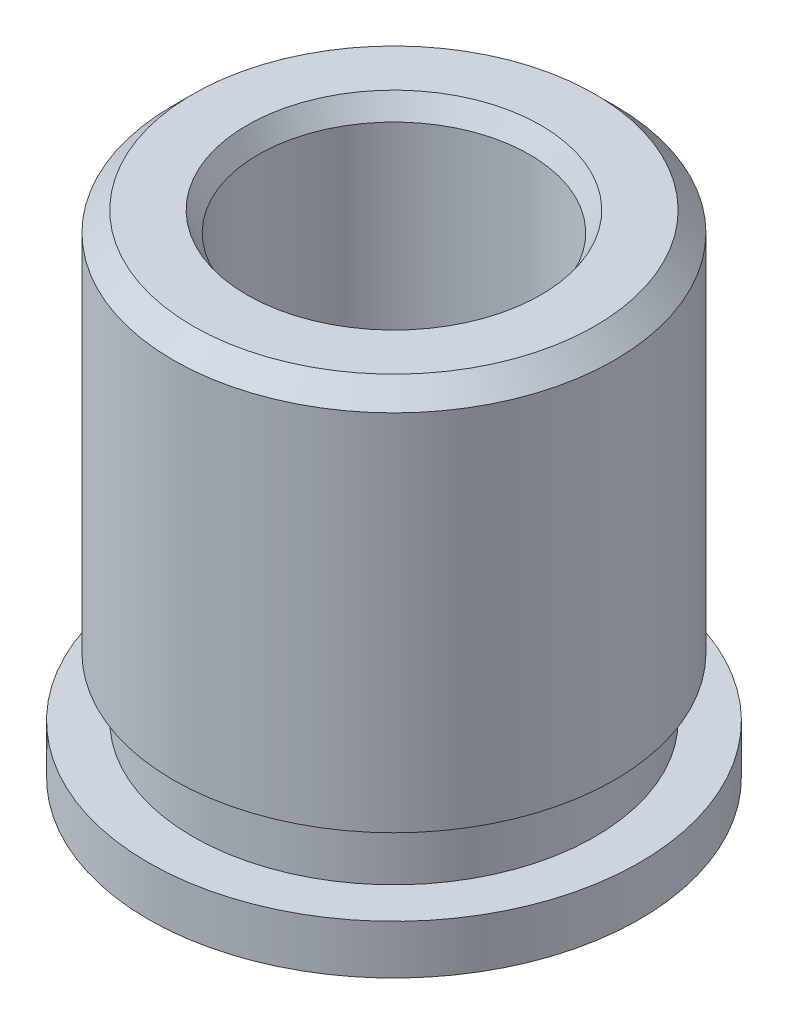
ISO-10303-21;
HEADER;
FILE_DESCRIPTION(('STEP AP214'),'2;1');
FILE_NAME('part.step','',(''),(''),'','','');
FILE_SCHEMA(('AUTOMOTIVE_DESIGN { 1 0 10303 214 1 1 1 1 }'));
ENDSEC;
DATA;
#1=APPLICATION_CONTEXT('core data for automotive mechanical design processes');
#2=APPLICATION_PROTOCOL_DEFINITION('international standard','automotive_design',2000,#1);
#3=PRODUCT_CONTEXT('',#1,'mechanical');
#4=PRODUCT('Part','Part','',(#3));
#5=PRODUCT_RELATED_PRODUCT_CATEGORY('part','',(#4));
#6=PRODUCT_DEFINITION_FORMATION('','',#4);
#7=PRODUCT_DEFINITION_CONTEXT('part definition',#1,'design');
#8=PRODUCT_DEFINITION('design','',#6,#7);
#9=PRODUCT_DEFINITION_SHAPE('','',#8);
#10=(LENGTH_UNIT() NAMED_UNIT(*) SI_UNIT(.MILLI.,.METRE.));
#11=(NAMED_UNIT(*) PLANE_ANGLE_UNIT() SI_UNIT($,.RADIAN.));
#12=(NAMED_UNIT(*) SI_UNIT($,.STERADIAN.) SOLID_ANGLE_UNIT());
#13=UNCERTAINTY_MEASURE_WITH_UNIT(LENGTH_MEASURE(1.E-05),#10,'distance_accuracy_value','');
#14=(GEOMETRIC_REPRESENTATION_CONTEXT(3) GLOBAL_UNCERTAINTY_ASSIGNED_CONTEXT((#13)) GLOBAL_UNIT_ASSIGNED_CONTEXT((#10,
#11,#12)) REPRESENTATION_CONTEXT('',''));
#15=CARTESIAN_POINT('',(0.,0.,0.));
#16=DIRECTION('',(0.,0.,1.));
#17=DIRECTION('',(1.,0.,0.));
#18=AXIS2_PLACEMENT_3D('',#15,#16,#17);
#19=CARTESIAN_POINT('',(0.,3.175,0.));
#20=DIRECTION('',(0.,1.,0.));
#21=DIRECTION('',(0.,0.,1.));
#22=AXIS2_PLACEMENT_3D('',#19,#20,#21);
#23=CYLINDRICAL_SURFACE('',#22,3.175);
#24=CARTESIAN_POINT('',(0.,-3.175,0.));
#25=DIRECTION('',(0.,1.,0.));
#26=DIRECTION('',(0.,0.,1.));
#27=AXIS2_PLACEMENT_3D('',#24,#25,#26);
#28=CIRCLE('',#27,3.175);
#29=CARTESIAN_POINT('',(0.,-3.175,3.175));
#30=VERTEX_POINT('',#29);
#31=EDGE_CURVE('E51',#30,#30,#28,.T.);
#32=ORIENTED_EDGE('',*,*,#31,.T.);
#33=EDGE_LOOP('',(#32));
#34=FACE_BOUND('',#33,.T.);
#35=CARTESIAN_POINT('',(0.,-2.54,0.));
#36=DIRECTION('',(0.,1.,0.));
#37=DIRECTION('',(0.,0.,1.));
#38=AXIS2_PLACEMENT_3D('',#35,#36,#37);
#39=CIRCLE('',#38,3.175);
#40=CARTESIAN_POINT('',(0.,-2.54,3.175));
#41=VERTEX_POINT('',#40);
#42=EDGE_CURVE('E9',#41,#41,#39,.T.);
#43=ORIENTED_EDGE('',*,*,#42,.F.);
#44=EDGE_LOOP('',(#43));
#45=FACE_BOUND('',#44,.T.);
#46=ADVANCED_FACE('F14',(#34,#45),#23,.T.);
#47=CARTESIAN_POINT('',(1.5875,-2.54,0.));
#48=DIRECTION('',(0.,1.,0.));
#49=DIRECTION('',(0.,0.,1.));
#50=AXIS2_PLACEMENT_3D('',#47,#48,#49);
#51=PLANE('',#50);
#52=ORIENTED_EDGE('',*,*,#42,.T.);
#53=EDGE_LOOP('',(#52));
#54=FACE_BOUND('',#53,.T.);
#55=CARTESIAN_POINT('',(0.,-2.54,0.));
#56=DIRECTION('',(0.,1.,0.));
#57=DIRECTION('',(0.,0.,1.));
#58=AXIS2_PLACEMENT_3D('',#55,#56,#57);
#59=CIRCLE('',#58,2.59715);
#60=CARTESIAN_POINT('',(0.,-2.54,2.59715));
#61=VERTEX_POINT('',#60);
#62=EDGE_CURVE('E20',#61,#61,#59,.T.);
#63=ORIENTED_EDGE('',*,*,#62,.F.);
#64=EDGE_LOOP('',(#63));
#65=FACE_BOUND('',#64,.T.);
#66=ADVANCED_FACE('F77',(#54,#65),#51,.T.);
#67=CARTESIAN_POINT('',(0.,3.175,0.));
#68=DIRECTION('',(0.,1.,0.));
#69=DIRECTION('',(0.,0.,1.));
#70=AXIS2_PLACEMENT_3D('',#67,#68,#69);
#71=CYLINDRICAL_SURFACE('',#70,2.59715);
#72=ORIENTED_EDGE('',*,*,#62,.T.);
#73=EDGE_LOOP('',(#72));
#74=FACE_BOUND('',#73,.T.);
#75=CARTESIAN_POINT('',(0.,-1.778,0.));
#76=DIRECTION('',(0.,1.,0.));
#77=DIRECTION('',(0.,0.,1.));
#78=AXIS2_PLACEMENT_3D('',#75,#76,#77);
#79=CIRCLE('',#78,2.59715);
#80=CARTESIAN_POINT('',(0.,-1.778,2.59715));
#81=VERTEX_POINT('',#80);
#82=EDGE_CURVE('E24',#81,#81,#79,.T.);
#83=ORIENTED_EDGE('',*,*,#82,.F.);
#84=EDGE_LOOP('',(#83));
#85=FACE_BOUND('',#84,.T.);
#86=ADVANCED_FACE('F82',(#74,#85),#71,.T.);
#87=CARTESIAN_POINT('',(1.5875,-1.778,0.));
#88=DIRECTION('',(0.,-1.,0.));
#89=DIRECTION('',(0.,0.,-1.));
#90=AXIS2_PLACEMENT_3D('',#87,#88,#89);
#91=PLANE('',#90);
#92=ORIENTED_EDGE('',*,*,#82,.T.);
#93=EDGE_LOOP('',(#92));
#94=FACE_BOUND('',#93,.T.);
#95=CARTESIAN_POINT('',(0.,-1.778,0.));
#96=DIRECTION('',(0.,1.,0.));
#97=DIRECTION('',(0.,0.,1.));
#98=AXIS2_PLACEMENT_3D('',#95,#96,#97);
#99=CIRCLE('',#98,2.85115);
#100=CARTESIAN_POINT('',(0.,-1.778,2.85115));
#101=VERTEX_POINT('',#100);
#102=EDGE_CURVE('E28',#101,#101,#99,.T.);
#103=ORIENTED_EDGE('',*,*,#102,.F.);
#104=EDGE_LOOP('',(#103));
#105=FACE_BOUND('',#104,.T.);
#106=ADVANCED_FACE('F87',(#94,#105),#91,.T.);
#107=CARTESIAN_POINT('',(0.,3.175,0.));
#108=DIRECTION('',(0.,1.,0.));
#109=DIRECTION('',(0.,0.,1.));
#110=AXIS2_PLACEMENT_3D('',#107,#108,#109);
#111=CYLINDRICAL_SURFACE('',#110,2.85115);
#112=ORIENTED_EDGE('',*,*,#102,.T.);
#113=EDGE_LOOP('',(#112));
#114=FACE_BOUND('',#113,.T.);
#115=CARTESIAN_POINT('',(0.,2.921,0.));
#116=DIRECTION('',(0.,1.,0.));
#117=DIRECTION('',(0.,0.,1.));
#118=AXIS2_PLACEMENT_3D('',#115,#116,#117);
#119=CIRCLE('',#118,2.85115);
#120=CARTESIAN_POINT('',(0.,2.921,2.85115));
#121=VERTEX_POINT('',#120);
#122=EDGE_CURVE('E33',#121,#121,#119,.T.);
#123=ORIENTED_EDGE('',*,*,#122,.F.);
#124=EDGE_LOOP('',(#123));
#125=FACE_BOUND('',#124,.T.);
#126=ADVANCED_FACE('F93',(#114,#125),#111,.T.);
#127=CARTESIAN_POINT('',(0.,3.175,0.));
#128=DIRECTION('',(0.,-1.,0.));
#129=DIRECTION('',(0.,0.,-1.));
#130=AXIS2_PLACEMENT_3D('',#127,#128,#129);
#131=CONICAL_SURFACE('',#130,2.59715,0.785398163397446);
#132=ORIENTED_EDGE('',*,*,#122,.T.);
#133=EDGE_LOOP('',(#132));
#134=FACE_BOUND('',#133,.T.);
#135=CARTESIAN_POINT('',(0.,3.175,0.));
#136=DIRECTION('',(0.,1.,0.));
#137=DIRECTION('',(0.,0.,1.));
#138=AXIS2_PLACEMENT_3D('',#135,#136,#137);
#139=CIRCLE('',#138,2.59715);
#140=CARTESIAN_POINT('',(0.,3.175,2.59715));
#141=VERTEX_POINT('',#140);
#142=EDGE_CURVE('E36',#141,#141,#139,.T.);
#143=ORIENTED_EDGE('',*,*,#142,.F.);
#144=EDGE_LOOP('',(#143));
#145=FACE_BOUND('',#144,.T.);
#146=ADVANCED_FACE('F97',(#134,#145),#131,.T.);
#147=CARTESIAN_POINT('',(1.5875,3.175,0.));
#148=DIRECTION('',(0.,1.,0.));
#149=DIRECTION('',(0.,0.,1.));
#150=AXIS2_PLACEMENT_3D('',#147,#148,#149);
#151=PLANE('',#150);
#152=ORIENTED_EDGE('',*,*,#142,.T.);
#153=EDGE_LOOP('',(#152));
#154=FACE_BOUND('',#153,.T.);
#155=CARTESIAN_POINT('',(0.,3.175,0.));
#156=DIRECTION('',(0.,1.,0.));
#157=DIRECTION('',(0.,0.,1.));
#158=AXIS2_PLACEMENT_3D('',#155,#156,#157);
#159=CIRCLE('',#158,1.89924696837417);
#160=CARTESIAN_POINT('',(0.,3.175,1.89924696837417));
#161=VERTEX_POINT('',#160);
#162=EDGE_CURVE('E39',#161,#161,#159,.T.);
#163=ORIENTED_EDGE('',*,*,#162,.F.);
#164=EDGE_LOOP('',(#163));
#165=FACE_BOUND('',#164,.T.);
#166=ADVANCED_FACE('F101',(#154,#165),#151,.T.);
#167=CARTESIAN_POINT('',(0.,2.921,0.));
#168=DIRECTION('',(0.,1.,0.));
#169=DIRECTION('',(0.,0.,1.));
#170=AXIS2_PLACEMENT_3D('',#167,#168,#169);
#171=CONICAL_SURFACE('',#170,1.7526,0.5235987755983);
#172=ORIENTED_EDGE('',*,*,#162,.T.);
#173=EDGE_LOOP('',(#172));
#174=FACE_BOUND('',#173,.T.);
#175=CARTESIAN_POINT('',(0.,2.921,0.));
#176=DIRECTION('',(0.,1.,0.));
#177=DIRECTION('',(0.,0.,1.));
#178=AXIS2_PLACEMENT_3D('',#175,#176,#177);
#179=CIRCLE('',#178,1.7526);
#180=CARTESIAN_POINT('',(0.,2.921,1.7526));
#181=VERTEX_POINT('',#180);
#182=EDGE_CURVE('E42',#181,#181,#179,.T.);
#183=ORIENTED_EDGE('',*,*,#182,.F.);
#184=EDGE_LOOP('',(#183));
#185=FACE_BOUND('',#184,.T.);
#186=ADVANCED_FACE('F73',(#174,#185),#171,.F.);
#187=CARTESIAN_POINT('',(0.,3.175,0.));
#188=DIRECTION('',(0.,1.,0.));
#189=DIRECTION('',(0.,0.,1.));
#190=AXIS2_PLACEMENT_3D('',#187,#188,#189);
#191=CYLINDRICAL_SURFACE('',#190,1.7526);
#192=ORIENTED_EDGE('',*,*,#182,.T.);
#193=EDGE_LOOP('',(#192));
#194=FACE_BOUND('',#193,.T.);
#195=CARTESIAN_POINT('',(0.,-2.921,0.));
#196=DIRECTION('',(0.,1.,0.));
#197=DIRECTION('',(0.,0.,1.));
#198=AXIS2_PLACEMENT_3D('',#195,#196,#197);
#199=CIRCLE('',#198,1.7526);
#200=CARTESIAN_POINT('',(0.,-2.921,1.7526));
#201=VERTEX_POINT('',#200);
#202=EDGE_CURVE('E45',#201,#201,#199,.T.);
#203=ORIENTED_EDGE('',*,*,#202,.F.);
#204=EDGE_LOOP('',(#203));
#205=FACE_BOUND('',#204,.T.);
#206=ADVANCED_FACE('F65',(#194,#205),#191,.F.);
#207=CARTESIAN_POINT('',(0.,-3.175,0.));
#208=DIRECTION('',(0.,-1.,0.));
#209=DIRECTION('',(0.,0.,-1.));
#210=AXIS2_PLACEMENT_3D('',#207,#208,#209);
#211=CONICAL_SURFACE('',#210,1.89924696837416,0.523598775598297);
#212=ORIENTED_EDGE('',*,*,#202,.T.);
#213=EDGE_LOOP('',(#212));
#214=FACE_BOUND('',#213,.T.);
#215=CARTESIAN_POINT('',(0.,-3.175,0.));
#216=DIRECTION('',(0.,1.,0.));
#217=DIRECTION('',(0.,0.,1.));
#218=AXIS2_PLACEMENT_3D('',#215,#216,#217);
#219=CIRCLE('',#218,1.89924696837416);
#220=CARTESIAN_POINT('',(0.,-3.175,1.89924696837416));
#221=VERTEX_POINT('',#220);
#222=EDGE_CURVE('E48',#221,#221,#219,.T.);
#223=ORIENTED_EDGE('',*,*,#222,.F.);
#224=EDGE_LOOP('',(#223));
#225=FACE_BOUND('',#224,.T.);
#226=ADVANCED_FACE('F60',(#214,#225),#211,.F.);
#227=CARTESIAN_POINT('',(1.5875,-3.175,0.));
#228=DIRECTION('',(0.,1.,0.));
#229=DIRECTION('',(0.,0.,1.));
#230=AXIS2_PLACEMENT_3D('',#227,#228,#229);
#231=PLANE('',#230);
#232=ORIENTED_EDGE('',*,*,#31,.F.);
#233=EDGE_LOOP('',(#232));
#234=FACE_BOUND('',#233,.T.);
#235=ORIENTED_EDGE('',*,*,#222,.T.);
#236=EDGE_LOOP('',(#235));
#237=FACE_BOUND('',#236,.T.);
#238=ADVANCED_FACE('F57',(#234,#237),#231,.F.);
#239=CLOSED_SHELL('',(#46,#66,#86,#106,#126,#146,#166,#186,#206,#226,#238));
#240=MANIFOLD_SOLID_BREP('B1',#239);
#241=ADVANCED_BREP_SHAPE_REPRESENTATION('',(#18,#240),#14);
#242=SHAPE_DEFINITION_REPRESENTATION(#9,#241);
ENDSEC;
END-ISO-10303-21;
